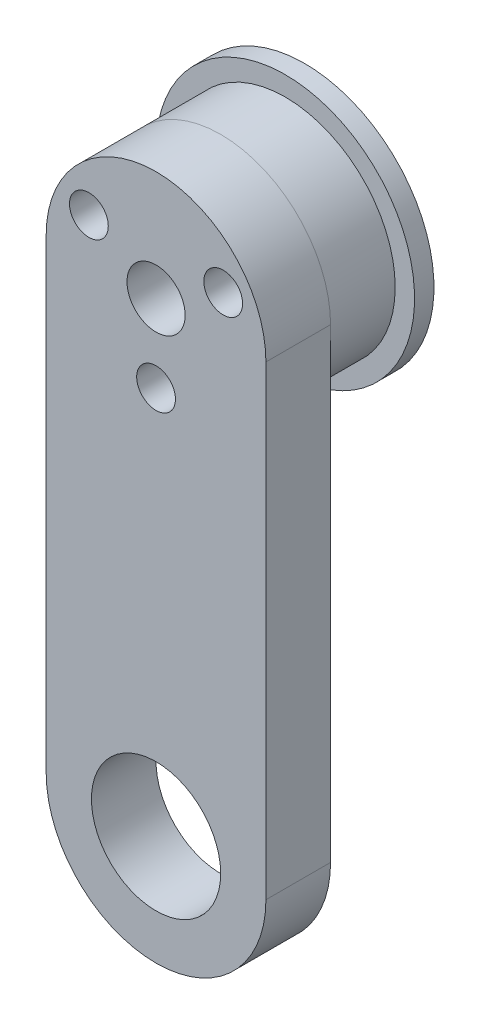
ISO-10303-21;
HEADER;
FILE_DESCRIPTION(('STEP AP214'),'2;1');
FILE_NAME('part.step','',(''),(''),'','','');
FILE_SCHEMA(('AUTOMOTIVE_DESIGN { 1 0 10303 214 1 1 1 1 }'));
ENDSEC;
DATA;
#1=APPLICATION_CONTEXT('core data for automotive mechanical design processes');
#2=APPLICATION_PROTOCOL_DEFINITION('international standard','automotive_design',2000,#1);
#3=PRODUCT_CONTEXT('',#1,'mechanical');
#4=PRODUCT('Part','Part','',(#3));
#5=PRODUCT_RELATED_PRODUCT_CATEGORY('part','',(#4));
#6=PRODUCT_DEFINITION_FORMATION('','',#4);
#7=PRODUCT_DEFINITION_CONTEXT('part definition',#1,'design');
#8=PRODUCT_DEFINITION('design','',#6,#7);
#9=PRODUCT_DEFINITION_SHAPE('','',#8);
#10=(LENGTH_UNIT() NAMED_UNIT(*) SI_UNIT(.MILLI.,.METRE.));
#11=(NAMED_UNIT(*) PLANE_ANGLE_UNIT() SI_UNIT($,.RADIAN.));
#12=(NAMED_UNIT(*) SI_UNIT($,.STERADIAN.) SOLID_ANGLE_UNIT());
#13=UNCERTAINTY_MEASURE_WITH_UNIT(LENGTH_MEASURE(1.E-05),#10,'distance_accuracy_value','');
#14=(GEOMETRIC_REPRESENTATION_CONTEXT(3) GLOBAL_UNCERTAINTY_ASSIGNED_CONTEXT((#13)) GLOBAL_UNIT_ASSIGNED_CONTEXT((#10,
#11,#12)) REPRESENTATION_CONTEXT('',''));
#15=CARTESIAN_POINT('',(0.,0.,0.));
#16=DIRECTION('',(0.,0.,1.));
#17=DIRECTION('',(1.,0.,0.));
#18=AXIS2_PLACEMENT_3D('',#15,#16,#17);
#19=CARTESIAN_POINT('',(0.,0.,-6.5));
#20=DIRECTION('',(0.,0.,-1.));
#21=DIRECTION('',(-1.,0.,0.));
#22=AXIS2_PLACEMENT_3D('',#19,#20,#21);
#23=PLANE('',#22);
#24=CARTESIAN_POINT('',(-5.19615242270663,3.,-6.5));
#25=DIRECTION('',(0.,0.,-1.));
#26=DIRECTION('',(-1.,0.,0.));
#27=AXIS2_PLACEMENT_3D('',#24,#25,#26);
#28=CIRCLE('',#27,1.5);
#29=CARTESIAN_POINT('',(-6.69615242270664,3.,-6.5));
#30=VERTEX_POINT('',#29);
#31=EDGE_CURVE('E65',#30,#30,#28,.T.);
#32=ORIENTED_EDGE('',*,*,#31,.F.);
#33=EDGE_LOOP('',(#32));
#34=FACE_BOUND('',#33,.T.);
#35=CARTESIAN_POINT('',(5.19615242270663,3.,-6.5));
#36=DIRECTION('',(0.,0.,-1.));
#37=DIRECTION('',(-1.,0.,0.));
#38=AXIS2_PLACEMENT_3D('',#35,#36,#37);
#39=CIRCLE('',#38,1.5);
#40=CARTESIAN_POINT('',(3.69615242270663,3.,-6.5));
#41=VERTEX_POINT('',#40);
#42=EDGE_CURVE('E54',#41,#41,#39,.T.);
#43=ORIENTED_EDGE('',*,*,#42,.F.);
#44=EDGE_LOOP('',(#43));
#45=FACE_BOUND('',#44,.T.);
#46=CARTESIAN_POINT('',(0.,0.,-6.5));
#47=DIRECTION('',(0.,0.,-1.));
#48=DIRECTION('',(-1.,0.,0.));
#49=AXIS2_PLACEMENT_3D('',#46,#47,#48);
#50=CIRCLE('',#49,9.99999999999999);
#51=CARTESIAN_POINT('',(-9.99999999999999,0.,-6.5));
#52=VERTEX_POINT('',#51);
#53=EDGE_CURVE('E11',#52,#52,#50,.T.);
#54=ORIENTED_EDGE('',*,*,#53,.T.);
#55=EDGE_LOOP('',(#54));
#56=FACE_BOUND('',#55,.T.);
#57=CARTESIAN_POINT('',(0.,0.,-6.5));
#58=DIRECTION('',(0.,0.,-1.));
#59=DIRECTION('',(-1.,0.,0.));
#60=AXIS2_PLACEMENT_3D('',#57,#58,#59);
#61=CIRCLE('',#60,3.35);
#62=CARTESIAN_POINT('',(-3.35,0.,-6.5));
#63=VERTEX_POINT('',#62);
#64=EDGE_CURVE('E59',#63,#63,#61,.T.);
#65=ORIENTED_EDGE('',*,*,#64,.F.);
#66=EDGE_LOOP('',(#65));
#67=FACE_BOUND('',#66,.T.);
#68=CARTESIAN_POINT('',(0.,-6.,-6.5));
#69=DIRECTION('',(0.,0.,-1.));
#70=DIRECTION('',(-1.,0.,0.));
#71=AXIS2_PLACEMENT_3D('',#68,#69,#70);
#72=CIRCLE('',#71,1.5);
#73=CARTESIAN_POINT('',(-1.5,-6.,-6.5));
#74=VERTEX_POINT('',#73);
#75=EDGE_CURVE('E71',#74,#74,#72,.T.);
#76=ORIENTED_EDGE('',*,*,#75,.F.);
#77=EDGE_LOOP('',(#76));
#78=FACE_BOUND('',#77,.T.);
#79=ADVANCED_FACE('F43',(#34,#45,#56,#67,#78),#23,.T.);
#80=CARTESIAN_POINT('',(0.,0.,-5.));
#81=DIRECTION('',(0.,0.,-1.));
#82=DIRECTION('',(-1.,0.,0.));
#83=AXIS2_PLACEMENT_3D('',#80,#81,#82);
#84=PLANE('',#83);
#85=CARTESIAN_POINT('',(0.,0.,-5.));
#86=DIRECTION('',(0.,0.,-1.));
#87=DIRECTION('',(-1.,0.,0.));
#88=AXIS2_PLACEMENT_3D('',#85,#86,#87);
#89=CIRCLE('',#88,9.99999999999999);
#90=CARTESIAN_POINT('',(-9.99999999999999,0.,-5.));
#91=VERTEX_POINT('',#90);
#92=EDGE_CURVE('E47',#91,#91,#89,.T.);
#93=ORIENTED_EDGE('',*,*,#92,.F.);
#94=EDGE_LOOP('',(#93));
#95=FACE_BOUND('',#94,.T.);
#96=CARTESIAN_POINT('',(5.19615242270663,3.,-5.));
#97=DIRECTION('',(0.,0.,-1.));
#98=DIRECTION('',(-1.,0.,0.));
#99=AXIS2_PLACEMENT_3D('',#96,#97,#98);
#100=CIRCLE('',#99,1.5);
#101=CARTESIAN_POINT('',(3.69615242270663,3.,-5.));
#102=VERTEX_POINT('',#101);
#103=EDGE_CURVE('E56',#102,#102,#100,.T.);
#104=ORIENTED_EDGE('',*,*,#103,.T.);
#105=EDGE_LOOP('',(#104));
#106=FACE_BOUND('',#105,.T.);
#107=CARTESIAN_POINT('',(0.,0.,-5.));
#108=DIRECTION('',(0.,0.,-1.));
#109=DIRECTION('',(-1.,0.,0.));
#110=AXIS2_PLACEMENT_3D('',#107,#108,#109);
#111=CIRCLE('',#110,3.35);
#112=CARTESIAN_POINT('',(-3.35,0.,-5.));
#113=VERTEX_POINT('',#112);
#114=EDGE_CURVE('E62',#113,#113,#111,.T.);
#115=ORIENTED_EDGE('',*,*,#114,.T.);
#116=EDGE_LOOP('',(#115));
#117=FACE_BOUND('',#116,.T.);
#118=CARTESIAN_POINT('',(-5.19615242270663,3.,-5.));
#119=DIRECTION('',(0.,0.,-1.));
#120=DIRECTION('',(-1.,0.,0.));
#121=AXIS2_PLACEMENT_3D('',#118,#119,#120);
#122=CIRCLE('',#121,1.5);
#123=CARTESIAN_POINT('',(-6.69615242270664,3.,-5.));
#124=VERTEX_POINT('',#123);
#125=EDGE_CURVE('E68',#124,#124,#122,.T.);
#126=ORIENTED_EDGE('',*,*,#125,.T.);
#127=EDGE_LOOP('',(#126));
#128=FACE_BOUND('',#127,.T.);
#129=CARTESIAN_POINT('',(0.,-6.,-5.));
#130=DIRECTION('',(0.,0.,-1.));
#131=DIRECTION('',(-1.,0.,0.));
#132=AXIS2_PLACEMENT_3D('',#129,#130,#131);
#133=CIRCLE('',#132,1.5);
#134=CARTESIAN_POINT('',(-1.5,-6.,-5.));
#135=VERTEX_POINT('',#134);
#136=EDGE_CURVE('E74',#135,#135,#133,.T.);
#137=ORIENTED_EDGE('',*,*,#136,.T.);
#138=EDGE_LOOP('',(#137));
#139=FACE_BOUND('',#138,.T.);
#140=ADVANCED_FACE('F84',(#95,#106,#117,#128,#139),#84,.F.);
#141=CARTESIAN_POINT('',(0.,0.,-6.5));
#142=DIRECTION('',(0.,0.,1.));
#143=DIRECTION('',(1.,0.,0.));
#144=AXIS2_PLACEMENT_3D('',#141,#142,#143);
#145=CYLINDRICAL_SURFACE('',#144,9.99999999999999);
#146=ORIENTED_EDGE('',*,*,#53,.F.);
#147=EDGE_LOOP('',(#146));
#148=FACE_BOUND('',#147,.T.);
#149=ORIENTED_EDGE('',*,*,#92,.T.);
#150=EDGE_LOOP('',(#149));
#151=FACE_BOUND('',#150,.T.);
#152=ADVANCED_FACE('F45',(#148,#151),#145,.T.);
#153=CARTESIAN_POINT('',(5.19615242270663,3.,-6.5));
#154=DIRECTION('',(0.,0.,1.));
#155=DIRECTION('',(1.,0.,0.));
#156=AXIS2_PLACEMENT_3D('',#153,#154,#155);
#157=CYLINDRICAL_SURFACE('',#156,1.5);
#158=ORIENTED_EDGE('',*,*,#42,.T.);
#159=EDGE_LOOP('',(#158));
#160=FACE_BOUND('',#159,.T.);
#161=ORIENTED_EDGE('',*,*,#103,.F.);
#162=EDGE_LOOP('',(#161));
#163=FACE_BOUND('',#162,.T.);
#164=ADVANCED_FACE('F94',(#160,#163),#157,.F.);
#165=CARTESIAN_POINT('',(0.,0.,-6.5));
#166=DIRECTION('',(0.,0.,1.));
#167=DIRECTION('',(1.,0.,0.));
#168=AXIS2_PLACEMENT_3D('',#165,#166,#167);
#169=CYLINDRICAL_SURFACE('',#168,3.35);
#170=ORIENTED_EDGE('',*,*,#64,.T.);
#171=EDGE_LOOP('',(#170));
#172=FACE_BOUND('',#171,.T.);
#173=ORIENTED_EDGE('',*,*,#114,.F.);
#174=EDGE_LOOP('',(#173));
#175=FACE_BOUND('',#174,.T.);
#176=ADVANCED_FACE('F97',(#172,#175),#169,.F.);
#177=CARTESIAN_POINT('',(-5.19615242270663,3.,-6.5));
#178=DIRECTION('',(0.,0.,1.));
#179=DIRECTION('',(1.,0.,0.));
#180=AXIS2_PLACEMENT_3D('',#177,#178,#179);
#181=CYLINDRICAL_SURFACE('',#180,1.5);
#182=ORIENTED_EDGE('',*,*,#31,.T.);
#183=EDGE_LOOP('',(#182));
#184=FACE_BOUND('',#183,.T.);
#185=ORIENTED_EDGE('',*,*,#125,.F.);
#186=EDGE_LOOP('',(#185));
#187=FACE_BOUND('',#186,.T.);
#188=ADVANCED_FACE('F101',(#184,#187),#181,.F.);
#189=CARTESIAN_POINT('',(0.,-6.,-6.5));
#190=DIRECTION('',(0.,0.,1.));
#191=DIRECTION('',(1.,0.,0.));
#192=AXIS2_PLACEMENT_3D('',#189,#190,#191);
#193=CYLINDRICAL_SURFACE('',#192,1.5);
#194=ORIENTED_EDGE('',*,*,#75,.T.);
#195=EDGE_LOOP('',(#194));
#196=FACE_BOUND('',#195,.T.);
#197=ORIENTED_EDGE('',*,*,#136,.F.);
#198=EDGE_LOOP('',(#197));
#199=FACE_BOUND('',#198,.T.);
#200=ADVANCED_FACE('F80',(#196,#199),#193,.F.);
#201=CLOSED_SHELL('',(#79,#140,#152,#164,#176,#188,#200));
#202=MANIFOLD_SOLID_BREP('B2',#201);
#203=CARTESIAN_POINT('',(0.,0.,-5.));
#204=DIRECTION('',(0.,0.,-1.));
#205=DIRECTION('',(-1.,0.,0.));
#206=AXIS2_PLACEMENT_3D('',#203,#204,#205);
#207=PLANE('',#206);
#208=CARTESIAN_POINT('',(0.,0.,-5.));
#209=DIRECTION('',(0.,0.,-1.));
#210=DIRECTION('',(-1.,0.,0.));
#211=AXIS2_PLACEMENT_3D('',#208,#209,#210);
#212=CIRCLE('',#211,3.35);
#213=CARTESIAN_POINT('',(-3.35,0.,-5.));
#214=VERTEX_POINT('',#213);
#215=EDGE_CURVE('E200',#214,#214,#212,.T.);
#216=ORIENTED_EDGE('',*,*,#215,.F.);
#217=EDGE_LOOP('',(#216));
#218=FACE_BOUND('',#217,.T.);
#219=CARTESIAN_POINT('',(0.,-6.,-5.));
#220=DIRECTION('',(0.,0.,-1.));
#221=DIRECTION('',(-1.,0.,0.));
#222=AXIS2_PLACEMENT_3D('',#219,#220,#221);
#223=CIRCLE('',#222,1.5);
#224=CARTESIAN_POINT('',(-1.5,-6.,-5.));
#225=VERTEX_POINT('',#224);
#226=EDGE_CURVE('E189',#225,#225,#223,.T.);
#227=ORIENTED_EDGE('',*,*,#226,.F.);
#228=EDGE_LOOP('',(#227));
#229=FACE_BOUND('',#228,.T.);
#230=CARTESIAN_POINT('',(0.,0.,-5.));
#231=DIRECTION('',(0.,0.,-1.));
#232=DIRECTION('',(-1.,0.,0.));
#233=AXIS2_PLACEMENT_3D('',#230,#231,#232);
#234=CIRCLE('',#233,8.49999999999999);
#235=CARTESIAN_POINT('',(-8.49999999999999,0.,-5.));
#236=VERTEX_POINT('',#235);
#237=EDGE_CURVE('E42',#236,#236,#234,.T.);
#238=ORIENTED_EDGE('',*,*,#237,.T.);
#239=EDGE_LOOP('',(#238));
#240=FACE_BOUND('',#239,.T.);
#241=CARTESIAN_POINT('',(-5.19615242270663,3.,-5.));
#242=DIRECTION('',(0.,0.,-1.));
#243=DIRECTION('',(-1.,0.,0.));
#244=AXIS2_PLACEMENT_3D('',#241,#242,#243);
#245=CIRCLE('',#244,1.5);
#246=CARTESIAN_POINT('',(-6.69615242270664,3.,-5.));
#247=VERTEX_POINT('',#246);
#248=EDGE_CURVE('E194',#247,#247,#245,.T.);
#249=ORIENTED_EDGE('',*,*,#248,.F.);
#250=EDGE_LOOP('',(#249));
#251=FACE_BOUND('',#250,.T.);
#252=CARTESIAN_POINT('',(5.19615242270663,3.,-5.));
#253=DIRECTION('',(0.,0.,-1.));
#254=DIRECTION('',(-1.,0.,0.));
#255=AXIS2_PLACEMENT_3D('',#252,#253,#254);
#256=CIRCLE('',#255,1.5);
#257=CARTESIAN_POINT('',(3.69615242270663,3.,-5.));
#258=VERTEX_POINT('',#257);
#259=EDGE_CURVE('E206',#258,#258,#256,.T.);
#260=ORIENTED_EDGE('',*,*,#259,.F.);
#261=EDGE_LOOP('',(#260));
#262=FACE_BOUND('',#261,.T.);
#263=ADVANCED_FACE('F178',(#218,#229,#240,#251,#262),#207,.T.);
#264=CARTESIAN_POINT('',(0.,0.,0.));
#265=DIRECTION('',(0.,0.,-1.));
#266=DIRECTION('',(-1.,0.,0.));
#267=AXIS2_PLACEMENT_3D('',#264,#265,#266);
#268=PLANE('',#267);
#269=CARTESIAN_POINT('',(0.,0.,0.));
#270=DIRECTION('',(0.,0.,-1.));
#271=DIRECTION('',(-1.,0.,0.));
#272=AXIS2_PLACEMENT_3D('',#269,#270,#271);
#273=CIRCLE('',#272,8.49999999999999);
#274=CARTESIAN_POINT('',(-8.49999999999999,0.,0.));
#275=VERTEX_POINT('',#274);
#276=EDGE_CURVE('E182',#275,#275,#273,.T.);
#277=ORIENTED_EDGE('',*,*,#276,.F.);
#278=EDGE_LOOP('',(#277));
#279=FACE_BOUND('',#278,.T.);
#280=CARTESIAN_POINT('',(0.,-6.,0.));
#281=DIRECTION('',(0.,0.,-1.));
#282=DIRECTION('',(-1.,0.,0.));
#283=AXIS2_PLACEMENT_3D('',#280,#281,#282);
#284=CIRCLE('',#283,1.5);
#285=CARTESIAN_POINT('',(-1.5,-6.,0.));
#286=VERTEX_POINT('',#285);
#287=EDGE_CURVE('E191',#286,#286,#284,.T.);
#288=ORIENTED_EDGE('',*,*,#287,.T.);
#289=EDGE_LOOP('',(#288));
#290=FACE_BOUND('',#289,.T.);
#291=CARTESIAN_POINT('',(-5.19615242270663,3.,0.));
#292=DIRECTION('',(0.,0.,-1.));
#293=DIRECTION('',(-1.,0.,0.));
#294=AXIS2_PLACEMENT_3D('',#291,#292,#293);
#295=CIRCLE('',#294,1.5);
#296=CARTESIAN_POINT('',(-6.69615242270664,3.,0.));
#297=VERTEX_POINT('',#296);
#298=EDGE_CURVE('E197',#297,#297,#295,.T.);
#299=ORIENTED_EDGE('',*,*,#298,.T.);
#300=EDGE_LOOP('',(#299));
#301=FACE_BOUND('',#300,.T.);
#302=CARTESIAN_POINT('',(0.,0.,0.));
#303=DIRECTION('',(0.,0.,-1.));
#304=DIRECTION('',(-1.,0.,0.));
#305=AXIS2_PLACEMENT_3D('',#302,#303,#304);
#306=CIRCLE('',#305,3.35);
#307=CARTESIAN_POINT('',(-3.35,0.,0.));
#308=VERTEX_POINT('',#307);
#309=EDGE_CURVE('E203',#308,#308,#306,.T.);
#310=ORIENTED_EDGE('',*,*,#309,.T.);
#311=EDGE_LOOP('',(#310));
#312=FACE_BOUND('',#311,.T.);
#313=CARTESIAN_POINT('',(5.19615242270663,3.,0.));
#314=DIRECTION('',(0.,0.,-1.));
#315=DIRECTION('',(-1.,0.,0.));
#316=AXIS2_PLACEMENT_3D('',#313,#314,#315);
#317=CIRCLE('',#316,1.5);
#318=CARTESIAN_POINT('',(3.69615242270663,3.,0.));
#319=VERTEX_POINT('',#318);
#320=EDGE_CURVE('E209',#319,#319,#317,.T.);
#321=ORIENTED_EDGE('',*,*,#320,.T.);
#322=EDGE_LOOP('',(#321));
#323=FACE_BOUND('',#322,.T.);
#324=ADVANCED_FACE('F219',(#279,#290,#301,#312,#323),#268,.F.);
#325=CARTESIAN_POINT('',(0.,0.,-5.));
#326=DIRECTION('',(0.,0.,1.));
#327=DIRECTION('',(1.,0.,0.));
#328=AXIS2_PLACEMENT_3D('',#325,#326,#327);
#329=CYLINDRICAL_SURFACE('',#328,8.49999999999999);
#330=ORIENTED_EDGE('',*,*,#237,.F.);
#331=EDGE_LOOP('',(#330));
#332=FACE_BOUND('',#331,.T.);
#333=ORIENTED_EDGE('',*,*,#276,.T.);
#334=EDGE_LOOP('',(#333));
#335=FACE_BOUND('',#334,.T.);
#336=ADVANCED_FACE('F180',(#332,#335),#329,.T.);
#337=CARTESIAN_POINT('',(0.,-6.,-5.));
#338=DIRECTION('',(0.,0.,1.));
#339=DIRECTION('',(1.,0.,0.));
#340=AXIS2_PLACEMENT_3D('',#337,#338,#339);
#341=CYLINDRICAL_SURFACE('',#340,1.5);
#342=ORIENTED_EDGE('',*,*,#226,.T.);
#343=EDGE_LOOP('',(#342));
#344=FACE_BOUND('',#343,.T.);
#345=ORIENTED_EDGE('',*,*,#287,.F.);
#346=EDGE_LOOP('',(#345));
#347=FACE_BOUND('',#346,.T.);
#348=ADVANCED_FACE('F229',(#344,#347),#341,.F.);
#349=CARTESIAN_POINT('',(-5.19615242270663,3.,-5.));
#350=DIRECTION('',(0.,0.,1.));
#351=DIRECTION('',(1.,0.,0.));
#352=AXIS2_PLACEMENT_3D('',#349,#350,#351);
#353=CYLINDRICAL_SURFACE('',#352,1.5);
#354=ORIENTED_EDGE('',*,*,#248,.T.);
#355=EDGE_LOOP('',(#354));
#356=FACE_BOUND('',#355,.T.);
#357=ORIENTED_EDGE('',*,*,#298,.F.);
#358=EDGE_LOOP('',(#357));
#359=FACE_BOUND('',#358,.T.);
#360=ADVANCED_FACE('F232',(#356,#359),#353,.F.);
#361=CARTESIAN_POINT('',(0.,0.,-5.));
#362=DIRECTION('',(0.,0.,1.));
#363=DIRECTION('',(1.,0.,0.));
#364=AXIS2_PLACEMENT_3D('',#361,#362,#363);
#365=CYLINDRICAL_SURFACE('',#364,3.35);
#366=ORIENTED_EDGE('',*,*,#215,.T.);
#367=EDGE_LOOP('',(#366));
#368=FACE_BOUND('',#367,.T.);
#369=ORIENTED_EDGE('',*,*,#309,.F.);
#370=EDGE_LOOP('',(#369));
#371=FACE_BOUND('',#370,.T.);
#372=ADVANCED_FACE('F236',(#368,#371),#365,.F.);
#373=CARTESIAN_POINT('',(5.19615242270663,3.,-5.));
#374=DIRECTION('',(0.,0.,1.));
#375=DIRECTION('',(1.,0.,0.));
#376=AXIS2_PLACEMENT_3D('',#373,#374,#375);
#377=CYLINDRICAL_SURFACE('',#376,1.5);
#378=ORIENTED_EDGE('',*,*,#259,.T.);
#379=EDGE_LOOP('',(#378));
#380=FACE_BOUND('',#379,.T.);
#381=ORIENTED_EDGE('',*,*,#320,.F.);
#382=EDGE_LOOP('',(#381));
#383=FACE_BOUND('',#382,.T.);
#384=ADVANCED_FACE('F215',(#380,#383),#377,.F.);
#385=CLOSED_SHELL('',(#263,#324,#336,#348,#360,#372,#384));
#386=MANIFOLD_SOLID_BREP('B6',#385);
#387=CARTESIAN_POINT('',(0.,-36.02986797,5.));
#388=DIRECTION('',(0.,0.,1.));
#389=DIRECTION('',(1.,0.,0.));
#390=AXIS2_PLACEMENT_3D('',#387,#388,#389);
#391=PLANE('',#390);
#392=CARTESIAN_POINT('',(0.,0.,5.));
#393=DIRECTION('',(0.,0.,1.));
#394=DIRECTION('',(1.,0.,0.));
#395=AXIS2_PLACEMENT_3D('',#392,#393,#394);
#396=CIRCLE('',#395,2.25);
#397=CARTESIAN_POINT('',(2.25,0.,5.));
#398=VERTEX_POINT('',#397);
#399=EDGE_CURVE('E398',#398,#398,#396,.T.);
#400=ORIENTED_EDGE('',*,*,#399,.F.);
#401=EDGE_LOOP('',(#400));
#402=FACE_BOUND('',#401,.T.);
#403=CARTESIAN_POINT('',(0.,-36.02986797,5.));
#404=DIRECTION('',(0.,0.,1.));
#405=DIRECTION('',(1.,0.,0.));
#406=AXIS2_PLACEMENT_3D('',#403,#404,#405);
#407=CIRCLE('',#406,5.00000000000001);
#408=CARTESIAN_POINT('',(5.00000000000001,-36.02986797,5.));
#409=VERTEX_POINT('',#408);
#410=EDGE_CURVE('E386',#409,#409,#407,.T.);
#411=ORIENTED_EDGE('',*,*,#410,.F.);
#412=EDGE_LOOP('',(#411));
#413=FACE_BOUND('',#412,.T.);
#414=CARTESIAN_POINT('',(0.,-36.02986797,5.));
#415=DIRECTION('',(0.,0.,1.));
#416=DIRECTION('',(1.,0.,0.));
#417=AXIS2_PLACEMENT_3D('',#414,#415,#416);
#418=CIRCLE('',#417,8.49999999999999);
#419=CARTESIAN_POINT('',(-8.49999999999999,-36.02986797,5.));
#420=VERTEX_POINT('',#419);
#421=CARTESIAN_POINT('',(8.49999999999999,-36.02986797,5.));
#422=VERTEX_POINT('',#421);
#423=EDGE_CURVE('E356',#420,#422,#418,.T.);
#424=ORIENTED_EDGE('',*,*,#423,.T.);
#425=DIRECTION('',(0.,1.,0.));
#426=VECTOR('',#425,1.);
#427=CARTESIAN_POINT('',(8.49999999999999,-36.02986797,5.));
#428=LINE('',#427,#426);
#429=CARTESIAN_POINT('',(8.49999999999999,0.,5.));
#430=VERTEX_POINT('',#429);
#431=EDGE_CURVE('E351',#422,#430,#428,.T.);
#432=ORIENTED_EDGE('',*,*,#431,.T.);
#433=CARTESIAN_POINT('',(0.,0.,5.));
#434=DIRECTION('',(0.,0.,1.));
#435=DIRECTION('',(1.,0.,0.));
#436=AXIS2_PLACEMENT_3D('',#433,#434,#435);
#437=CIRCLE('',#436,8.49999999999999);
#438=CARTESIAN_POINT('',(-8.49999999999999,0.,5.));
#439=VERTEX_POINT('',#438);
#440=EDGE_CURVE('E354',#430,#439,#437,.T.);
#441=ORIENTED_EDGE('',*,*,#440,.T.);
#442=DIRECTION('',(0.,-1.,0.));
#443=VECTOR('',#442,1.);
#444=CARTESIAN_POINT('',(-8.49999999999999,-36.02986797,5.));
#445=LINE('',#444,#443);
#446=EDGE_CURVE('E321',#439,#420,#445,.T.);
#447=ORIENTED_EDGE('',*,*,#446,.T.);
#448=EDGE_LOOP('',(#424,#432,#441,#447));
#449=FACE_BOUND('',#448,.T.);
#450=CARTESIAN_POINT('',(-5.19615242270663,3.,5.));
#451=DIRECTION('',(0.,0.,1.));
#452=DIRECTION('',(1.,0.,0.));
#453=AXIS2_PLACEMENT_3D('',#450,#451,#452);
#454=CIRCLE('',#453,1.5);
#455=CARTESIAN_POINT('',(-3.69615242270663,3.,5.));
#456=VERTEX_POINT('',#455);
#457=EDGE_CURVE('E371',#456,#456,#454,.T.);
#458=ORIENTED_EDGE('',*,*,#457,.F.);
#459=EDGE_LOOP('',(#458));
#460=FACE_BOUND('',#459,.T.);
#461=CARTESIAN_POINT('',(5.19615242270663,3.,5.));
#462=DIRECTION('',(0.,0.,1.));
#463=DIRECTION('',(1.,0.,0.));
#464=AXIS2_PLACEMENT_3D('',#461,#462,#463);
#465=CIRCLE('',#464,1.5);
#466=CARTESIAN_POINT('',(6.69615242270663,3.,5.));
#467=VERTEX_POINT('',#466);
#468=EDGE_CURVE('E392',#467,#467,#465,.T.);
#469=ORIENTED_EDGE('',*,*,#468,.F.);
#470=EDGE_LOOP('',(#469));
#471=FACE_BOUND('',#470,.T.);
#472=CARTESIAN_POINT('',(0.,-6.,5.));
#473=DIRECTION('',(0.,0.,1.));
#474=DIRECTION('',(1.,0.,0.));
#475=AXIS2_PLACEMENT_3D('',#472,#473,#474);
#476=CIRCLE('',#475,1.5);
#477=CARTESIAN_POINT('',(1.5,-6.,5.));
#478=VERTEX_POINT('',#477);
#479=EDGE_CURVE('E404',#478,#478,#476,.T.);
#480=ORIENTED_EDGE('',*,*,#479,.F.);
#481=EDGE_LOOP('',(#480));
#482=FACE_BOUND('',#481,.T.);
#483=ADVANCED_FACE('F304',(#402,#413,#449,#460,#471,#482),#391,.T.);
#484=CARTESIAN_POINT('',(0.,-36.02986797,0.));
#485=DIRECTION('',(0.,0.,1.));
#486=DIRECTION('',(1.,0.,0.));
#487=AXIS2_PLACEMENT_3D('',#484,#485,#486);
#488=PLANE('',#487);
#489=CARTESIAN_POINT('',(0.,-36.02986797,0.));
#490=DIRECTION('',(0.,0.,1.));
#491=DIRECTION('',(1.,0.,0.));
#492=AXIS2_PLACEMENT_3D('',#489,#490,#491);
#493=CIRCLE('',#492,8.49999999999999);
#494=CARTESIAN_POINT('',(-8.49999999999999,-36.02986797,0.));
#495=VERTEX_POINT('',#494);
#496=CARTESIAN_POINT('',(8.49999999999999,-36.02986797,0.));
#497=VERTEX_POINT('',#496);
#498=EDGE_CURVE('E368',#495,#497,#493,.T.);
#499=ORIENTED_EDGE('',*,*,#498,.F.);
#500=DIRECTION('',(0.,-1.,0.));
#501=VECTOR('',#500,1.);
#502=CARTESIAN_POINT('',(-8.49999999999999,-36.02986797,0.));
#503=LINE('',#502,#501);
#504=CARTESIAN_POINT('',(-8.49999999999999,0.,0.));
#505=VERTEX_POINT('',#504);
#506=EDGE_CURVE('E344',#505,#495,#503,.T.);
#507=ORIENTED_EDGE('',*,*,#506,.F.);
#508=CARTESIAN_POINT('',(0.,0.,0.));
#509=DIRECTION('',(0.,0.,1.));
#510=DIRECTION('',(1.,0.,0.));
#511=AXIS2_PLACEMENT_3D('',#508,#509,#510);
#512=CIRCLE('',#511,8.49999999999999);
#513=CARTESIAN_POINT('',(8.49999999999999,0.,0.));
#514=VERTEX_POINT('',#513);
#515=EDGE_CURVE('E338',#514,#505,#512,.T.);
#516=ORIENTED_EDGE('',*,*,#515,.F.);
#517=DIRECTION('',(0.,1.,0.));
#518=VECTOR('',#517,1.);
#519=CARTESIAN_POINT('',(8.49999999999999,-36.02986797,0.));
#520=LINE('',#519,#518);
#521=EDGE_CURVE('E360',#497,#514,#520,.T.);
#522=ORIENTED_EDGE('',*,*,#521,.F.);
#523=EDGE_LOOP('',(#499,#507,#516,#522));
#524=FACE_BOUND('',#523,.T.);
#525=CARTESIAN_POINT('',(-5.19615242270663,3.,0.));
#526=DIRECTION('',(0.,0.,1.));
#527=DIRECTION('',(1.,0.,0.));
#528=AXIS2_PLACEMENT_3D('',#525,#526,#527);
#529=CIRCLE('',#528,1.5);
#530=CARTESIAN_POINT('',(-3.69615242270663,3.,0.));
#531=VERTEX_POINT('',#530);
#532=EDGE_CURVE('E383',#531,#531,#529,.T.);
#533=ORIENTED_EDGE('',*,*,#532,.T.);
#534=EDGE_LOOP('',(#533));
#535=FACE_BOUND('',#534,.T.);
#536=CARTESIAN_POINT('',(0.,-36.02986797,0.));
#537=DIRECTION('',(0.,0.,1.));
#538=DIRECTION('',(1.,0.,0.));
#539=AXIS2_PLACEMENT_3D('',#536,#537,#538);
#540=CIRCLE('',#539,5.00000000000001);
#541=CARTESIAN_POINT('',(5.00000000000001,-36.02986797,0.));
#542=VERTEX_POINT('',#541);
#543=EDGE_CURVE('E389',#542,#542,#540,.T.);
#544=ORIENTED_EDGE('',*,*,#543,.T.);
#545=EDGE_LOOP('',(#544));
#546=FACE_BOUND('',#545,.T.);
#547=CARTESIAN_POINT('',(5.19615242270663,3.,0.));
#548=DIRECTION('',(0.,0.,1.));
#549=DIRECTION('',(1.,0.,0.));
#550=AXIS2_PLACEMENT_3D('',#547,#548,#549);
#551=CIRCLE('',#550,1.5);
#552=CARTESIAN_POINT('',(6.69615242270663,3.,0.));
#553=VERTEX_POINT('',#552);
#554=EDGE_CURVE('E395',#553,#553,#551,.T.);
#555=ORIENTED_EDGE('',*,*,#554,.T.);
#556=EDGE_LOOP('',(#555));
#557=FACE_BOUND('',#556,.T.);
#558=CARTESIAN_POINT('',(0.,0.,0.));
#559=DIRECTION('',(0.,0.,1.));
#560=DIRECTION('',(1.,0.,0.));
#561=AXIS2_PLACEMENT_3D('',#558,#559,#560);
#562=CIRCLE('',#561,2.25);
#563=CARTESIAN_POINT('',(2.25,0.,0.));
#564=VERTEX_POINT('',#563);
#565=EDGE_CURVE('E401',#564,#564,#562,.T.);
#566=ORIENTED_EDGE('',*,*,#565,.T.);
#567=EDGE_LOOP('',(#566));
#568=FACE_BOUND('',#567,.T.);
#569=CARTESIAN_POINT('',(0.,-6.,0.));
#570=DIRECTION('',(0.,0.,1.));
#571=DIRECTION('',(1.,0.,0.));
#572=AXIS2_PLACEMENT_3D('',#569,#570,#571);
#573=CIRCLE('',#572,1.5);
#574=CARTESIAN_POINT('',(1.5,-6.,0.));
#575=VERTEX_POINT('',#574);
#576=EDGE_CURVE('E407',#575,#575,#573,.T.);
#577=ORIENTED_EDGE('',*,*,#576,.T.);
#578=EDGE_LOOP('',(#577));
#579=FACE_BOUND('',#578,.T.);
#580=ADVANCED_FACE('F379',(#524,#535,#546,#557,#568,#579),#488,.F.);
#581=CARTESIAN_POINT('',(0.,-36.02986797,5.));
#582=DIRECTION('',(0.,0.,-1.));
#583=DIRECTION('',(-1.,0.,0.));
#584=AXIS2_PLACEMENT_3D('',#581,#582,#583);
#585=CYLINDRICAL_SURFACE('',#584,8.49999999999999);
#586=ORIENTED_EDGE('',*,*,#498,.T.);
#587=DIRECTION('',(0.,0.,-1.));
#588=VECTOR('',#587,1.);
#589=CARTESIAN_POINT('',(8.49999999999999,-36.02986797,5.));
#590=LINE('',#589,#588);
#591=EDGE_CURVE('E176',#422,#497,#590,.T.);
#592=ORIENTED_EDGE('',*,*,#591,.F.);
#593=ORIENTED_EDGE('',*,*,#423,.F.);
#594=DIRECTION('',(0.,0.,-1.));
#595=VECTOR('',#594,1.);
#596=CARTESIAN_POINT('',(-8.49999999999999,-36.02986797,5.));
#597=LINE('',#596,#595);
#598=EDGE_CURVE('E364',#420,#495,#597,.T.);
#599=ORIENTED_EDGE('',*,*,#598,.T.);
#600=EDGE_LOOP('',(#586,#592,#593,#599));
#601=FACE_BOUND('',#600,.T.);
#602=ADVANCED_FACE('F306',(#601),#585,.T.);
#603=CARTESIAN_POINT('',(8.49999999999999,-36.02986797,5.));
#604=DIRECTION('',(-1.,0.,0.));
#605=DIRECTION('',(0.,-1.,0.));
#606=AXIS2_PLACEMENT_3D('',#603,#604,#605);
#607=PLANE('',#606);
#608=ORIENTED_EDGE('',*,*,#521,.T.);
#609=DIRECTION('',(0.,0.,-1.));
#610=VECTOR('',#609,1.);
#611=CARTESIAN_POINT('',(8.49999999999999,0.,5.));
#612=LINE('',#611,#610);
#613=EDGE_CURVE('E313',#430,#514,#612,.T.);
#614=ORIENTED_EDGE('',*,*,#613,.F.);
#615=ORIENTED_EDGE('',*,*,#431,.F.);
#616=ORIENTED_EDGE('',*,*,#591,.T.);
#617=EDGE_LOOP('',(#608,#614,#615,#616));
#618=FACE_BOUND('',#617,.T.);
#619=ADVANCED_FACE('F359',(#618),#607,.F.);
#620=CARTESIAN_POINT('',(0.,0.,5.));
#621=DIRECTION('',(0.,0.,-1.));
#622=DIRECTION('',(-1.,0.,0.));
#623=AXIS2_PLACEMENT_3D('',#620,#621,#622);
#624=CYLINDRICAL_SURFACE('',#623,8.49999999999999);
#625=ORIENTED_EDGE('',*,*,#515,.T.);
#626=DIRECTION('',(0.,0.,-1.));
#627=VECTOR('',#626,1.);
#628=CARTESIAN_POINT('',(-8.49999999999999,0.,5.));
#629=LINE('',#628,#627);
#630=EDGE_CURVE('E361',#439,#505,#629,.T.);
#631=ORIENTED_EDGE('',*,*,#630,.F.);
#632=ORIENTED_EDGE('',*,*,#440,.F.);
#633=ORIENTED_EDGE('',*,*,#613,.T.);
#634=EDGE_LOOP('',(#625,#631,#632,#633));
#635=FACE_BOUND('',#634,.T.);
#636=ADVANCED_FACE('F362',(#635),#624,.T.);
#637=CARTESIAN_POINT('',(-8.49999999999999,-36.02986797,5.));
#638=DIRECTION('',(1.,0.,0.));
#639=DIRECTION('',(0.,1.,0.));
#640=AXIS2_PLACEMENT_3D('',#637,#638,#639);
#641=PLANE('',#640);
#642=ORIENTED_EDGE('',*,*,#506,.T.);
#643=ORIENTED_EDGE('',*,*,#598,.F.);
#644=ORIENTED_EDGE('',*,*,#446,.F.);
#645=ORIENTED_EDGE('',*,*,#630,.T.);
#646=EDGE_LOOP('',(#642,#643,#644,#645));
#647=FACE_BOUND('',#646,.T.);
#648=ADVANCED_FACE('F376',(#647),#641,.F.);
#649=CARTESIAN_POINT('',(-5.19615242270663,3.,5.));
#650=DIRECTION('',(0.,0.,-1.));
#651=DIRECTION('',(-1.,0.,0.));
#652=AXIS2_PLACEMENT_3D('',#649,#650,#651);
#653=CYLINDRICAL_SURFACE('',#652,1.5);
#654=ORIENTED_EDGE('',*,*,#457,.T.);
#655=EDGE_LOOP('',(#654));
#656=FACE_BOUND('',#655,.T.);
#657=ORIENTED_EDGE('',*,*,#532,.F.);
#658=EDGE_LOOP('',(#657));
#659=FACE_BOUND('',#658,.T.);
#660=ADVANCED_FACE('F426',(#656,#659),#653,.F.);
#661=CARTESIAN_POINT('',(0.,-36.02986797,5.));
#662=DIRECTION('',(0.,0.,-1.));
#663=DIRECTION('',(-1.,0.,0.));
#664=AXIS2_PLACEMENT_3D('',#661,#662,#663);
#665=CYLINDRICAL_SURFACE('',#664,5.00000000000001);
#666=ORIENTED_EDGE('',*,*,#410,.T.);
#667=EDGE_LOOP('',(#666));
#668=FACE_BOUND('',#667,.T.);
#669=ORIENTED_EDGE('',*,*,#543,.F.);
#670=EDGE_LOOP('',(#669));
#671=FACE_BOUND('',#670,.T.);
#672=ADVANCED_FACE('F474',(#668,#671),#665,.F.);
#673=CARTESIAN_POINT('',(5.19615242270663,3.,5.));
#674=DIRECTION('',(0.,0.,-1.));
#675=DIRECTION('',(-1.,0.,0.));
#676=AXIS2_PLACEMENT_3D('',#673,#674,#675);
#677=CYLINDRICAL_SURFACE('',#676,1.5);
#678=ORIENTED_EDGE('',*,*,#468,.T.);
#679=EDGE_LOOP('',(#678));
#680=FACE_BOUND('',#679,.T.);
#681=ORIENTED_EDGE('',*,*,#554,.F.);
#682=EDGE_LOOP('',(#681));
#683=FACE_BOUND('',#682,.T.);
#684=ADVANCED_FACE('F482',(#680,#683),#677,.F.);
#685=CARTESIAN_POINT('',(0.,0.,5.));
#686=DIRECTION('',(0.,0.,-1.));
#687=DIRECTION('',(-1.,0.,0.));
#688=AXIS2_PLACEMENT_3D('',#685,#686,#687);
#689=CYLINDRICAL_SURFACE('',#688,2.25);
#690=ORIENTED_EDGE('',*,*,#399,.T.);
#691=EDGE_LOOP('',(#690));
#692=FACE_BOUND('',#691,.T.);
#693=ORIENTED_EDGE('',*,*,#565,.F.);
#694=EDGE_LOOP('',(#693));
#695=FACE_BOUND('',#694,.T.);
#696=ADVANCED_FACE('F490',(#692,#695),#689,.F.);
#697=CARTESIAN_POINT('',(0.,-6.,5.));
#698=DIRECTION('',(0.,0.,-1.));
#699=DIRECTION('',(-1.,0.,0.));
#700=AXIS2_PLACEMENT_3D('',#697,#698,#699);
#701=CYLINDRICAL_SURFACE('',#700,1.5);
#702=ORIENTED_EDGE('',*,*,#479,.T.);
#703=EDGE_LOOP('',(#702));
#704=FACE_BOUND('',#703,.T.);
#705=ORIENTED_EDGE('',*,*,#576,.F.);
#706=EDGE_LOOP('',(#705));
#707=FACE_BOUND('',#706,.T.);
#708=ADVANCED_FACE('F413',(#704,#707),#701,.F.);
#709=CLOSED_SHELL('',(#483,#580,#602,#619,#636,#648,#660,#672,#684,#696,#708));
#710=MANIFOLD_SOLID_BREP('B37',#709);
#711=ADVANCED_BREP_SHAPE_REPRESENTATION('',(#18,#202,#386,#710),#14);
#712=SHAPE_DEFINITION_REPRESENTATION(#9,#711);
ENDSEC;
END-ISO-10303-21;
